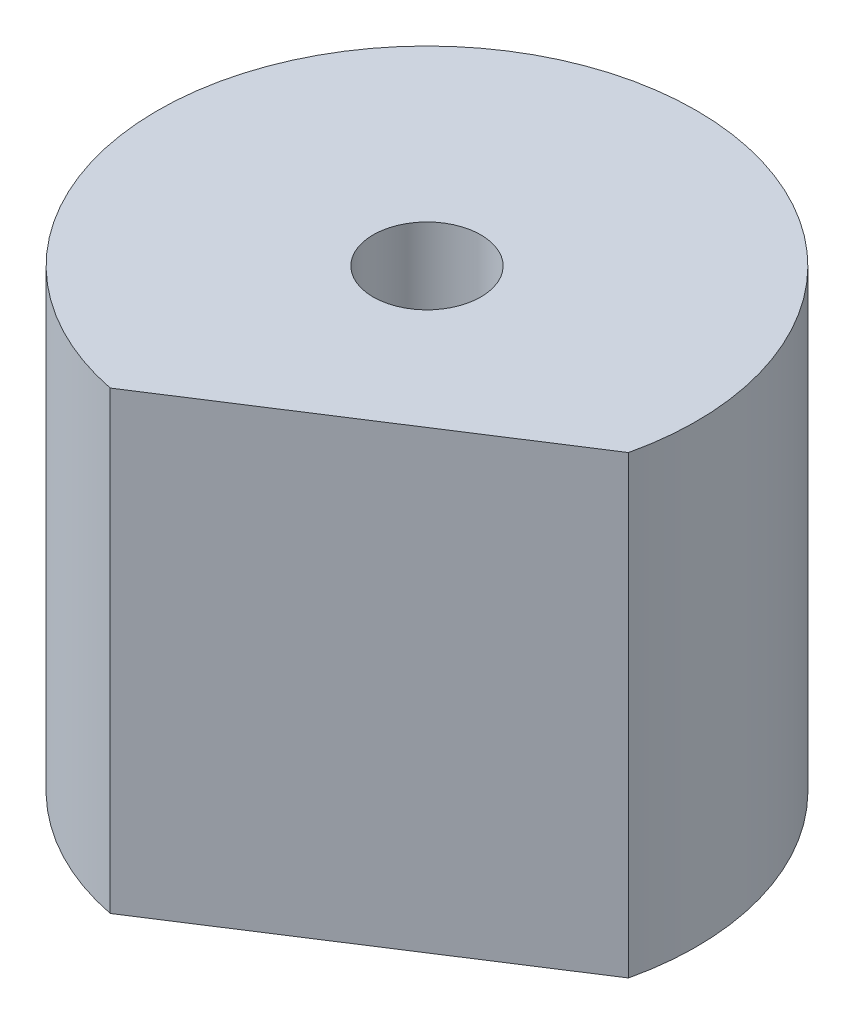
ISO-10303-21;
HEADER;
FILE_DESCRIPTION(('STEP AP214'),'2;1');
FILE_NAME('part.step','',(''),(''),'','','');
FILE_SCHEMA(('AUTOMOTIVE_DESIGN { 1 0 10303 214 1 1 1 1 }'));
ENDSEC;
DATA;
#1=APPLICATION_CONTEXT('core data for automotive mechanical design processes');
#2=APPLICATION_PROTOCOL_DEFINITION('international standard','automotive_design',2000,#1);
#3=PRODUCT_CONTEXT('',#1,'mechanical');
#4=PRODUCT('Part','Part','',(#3));
#5=PRODUCT_RELATED_PRODUCT_CATEGORY('part','',(#4));
#6=PRODUCT_DEFINITION_FORMATION('','',#4);
#7=PRODUCT_DEFINITION_CONTEXT('part definition',#1,'design');
#8=PRODUCT_DEFINITION('design','',#6,#7);
#9=PRODUCT_DEFINITION_SHAPE('','',#8);
#10=(LENGTH_UNIT() NAMED_UNIT(*) SI_UNIT(.MILLI.,.METRE.));
#11=(NAMED_UNIT(*) PLANE_ANGLE_UNIT() SI_UNIT($,.RADIAN.));
#12=(NAMED_UNIT(*) SI_UNIT($,.STERADIAN.) SOLID_ANGLE_UNIT());
#13=UNCERTAINTY_MEASURE_WITH_UNIT(LENGTH_MEASURE(1.E-05),#10,'distance_accuracy_value','');
#14=(GEOMETRIC_REPRESENTATION_CONTEXT(3) GLOBAL_UNCERTAINTY_ASSIGNED_CONTEXT((#13)) GLOBAL_UNIT_ASSIGNED_CONTEXT((#10,
#11,#12)) REPRESENTATION_CONTEXT('',''));
#15=CARTESIAN_POINT('',(0.,0.,0.));
#16=DIRECTION('',(0.,0.,1.));
#17=DIRECTION('',(1.,0.,0.));
#18=AXIS2_PLACEMENT_3D('',#15,#16,#17);
#19=CARTESIAN_POINT('',(0.,13.4112,0.));
#20=DIRECTION('',(0.,1.,0.));
#21=DIRECTION('',(0.,0.,1.));
#22=AXIS2_PLACEMENT_3D('',#19,#20,#21);
#23=PLANE('',#22);
#24=DIRECTION('',(-0.840244301090641,0.,0.542207999281364));
#25=VECTOR('',#24,1.);
#26=CARTESIAN_POINT('',(3.09054350014873,13.4112,4.78932728162343));
#27=LINE('',#26,#25);
#28=CARTESIAN_POINT('',(7.73206939476792,13.4112,1.79415972658324));
#29=VERTEX_POINT('',#28);
#30=CARTESIAN_POINT('',(-1.55098239447046,13.4112,7.78449483666363));
#31=VERTEX_POINT('',#30);
#32=EDGE_CURVE('E62',#29,#31,#27,.T.);
#33=ORIENTED_EDGE('',*,*,#32,.F.);
#34=CARTESIAN_POINT('',(0.,13.4112,0.));
#35=DIRECTION('',(0.,1.,0.));
#36=DIRECTION('',(0.,0.,1.));
#37=AXIS2_PLACEMENT_3D('',#34,#35,#36);
#38=CIRCLE('',#37,7.9375);
#39=EDGE_CURVE('E76',#29,#31,#38,.T.);
#40=ORIENTED_EDGE('',*,*,#39,.T.);
#41=EDGE_LOOP('',(#33,#40));
#42=FACE_BOUND('',#41,.T.);
#43=CARTESIAN_POINT('',(0.,13.4112,0.));
#44=DIRECTION('',(0.,1.,0.));
#45=DIRECTION('',(0.,0.,1.));
#46=AXIS2_PLACEMENT_3D('',#43,#44,#45);
#47=CIRCLE('',#46,1.5875);
#48=CARTESIAN_POINT('',(0.,13.4112,1.5875));
#49=VERTEX_POINT('',#48);
#50=EDGE_CURVE('E83',#49,#49,#47,.T.);
#51=ORIENTED_EDGE('',*,*,#50,.F.);
#52=EDGE_LOOP('',(#51));
#53=FACE_BOUND('',#52,.T.);
#54=ADVANCED_FACE('F47',(#42,#53),#23,.T.);
#55=CARTESIAN_POINT('',(0.,0.,0.));
#56=DIRECTION('',(0.,1.,0.));
#57=DIRECTION('',(0.,0.,1.));
#58=AXIS2_PLACEMENT_3D('',#55,#56,#57);
#59=PLANE('',#58);
#60=CARTESIAN_POINT('',(0.,0.,0.));
#61=DIRECTION('',(0.,1.,0.));
#62=DIRECTION('',(0.,0.,1.));
#63=AXIS2_PLACEMENT_3D('',#60,#61,#62);
#64=CIRCLE('',#63,7.9375);
#65=CARTESIAN_POINT('',(7.73206939476792,0.,1.79415972658324));
#66=VERTEX_POINT('',#65);
#67=CARTESIAN_POINT('',(-1.55098239447046,0.,7.78449483666363));
#68=VERTEX_POINT('',#67);
#69=EDGE_CURVE('E81',#66,#68,#64,.T.);
#70=ORIENTED_EDGE('',*,*,#69,.F.);
#71=DIRECTION('',(-0.840244301090641,0.,0.542207999281364));
#72=VECTOR('',#71,1.);
#73=CARTESIAN_POINT('',(3.09054350014873,0.,4.78932728162343));
#74=LINE('',#73,#72);
#75=EDGE_CURVE('E71',#66,#68,#74,.T.);
#76=ORIENTED_EDGE('',*,*,#75,.T.);
#77=EDGE_LOOP('',(#70,#76));
#78=FACE_BOUND('',#77,.T.);
#79=CARTESIAN_POINT('',(0.,0.,0.));
#80=DIRECTION('',(0.,1.,0.));
#81=DIRECTION('',(0.,0.,1.));
#82=AXIS2_PLACEMENT_3D('',#79,#80,#81);
#83=CIRCLE('',#82,1.5875);
#84=CARTESIAN_POINT('',(0.,0.,1.5875));
#85=VERTEX_POINT('',#84);
#86=EDGE_CURVE('E87',#85,#85,#83,.T.);
#87=ORIENTED_EDGE('',*,*,#86,.T.);
#88=EDGE_LOOP('',(#87));
#89=FACE_BOUND('',#88,.T.);
#90=ADVANCED_FACE('F79',(#78,#89),#59,.F.);
#91=CARTESIAN_POINT('',(0.,13.4112,0.));
#92=DIRECTION('',(0.,-1.,0.));
#93=DIRECTION('',(0.,0.,-1.));
#94=AXIS2_PLACEMENT_3D('',#91,#92,#93);
#95=CYLINDRICAL_SURFACE('',#94,7.9375);
#96=ORIENTED_EDGE('',*,*,#39,.F.);
#97=DIRECTION('',(0.,-1.,0.));
#98=VECTOR('',#97,1.);
#99=CARTESIAN_POINT('',(7.73206939476792,13.4112,1.79415972658324));
#100=LINE('',#99,#98);
#101=EDGE_CURVE('E13',#29,#66,#100,.T.);
#102=ORIENTED_EDGE('',*,*,#101,.T.);
#103=ORIENTED_EDGE('',*,*,#69,.T.);
#104=DIRECTION('',(0.,-1.,0.));
#105=VECTOR('',#104,1.);
#106=CARTESIAN_POINT('',(-1.55098239447046,13.4112,7.78449483666363));
#107=LINE('',#106,#105);
#108=EDGE_CURVE('E55',#68,#31,#107,.F.);
#109=ORIENTED_EDGE('',*,*,#108,.T.);
#110=EDGE_LOOP('',(#96,#102,#103,#109));
#111=FACE_BOUND('',#110,.T.);
#112=ADVANCED_FACE('F49',(#111),#95,.T.);
#113=CARTESIAN_POINT('',(0.,13.4112,0.));
#114=DIRECTION('',(0.,-1.,0.));
#115=DIRECTION('',(0.,0.,-1.));
#116=AXIS2_PLACEMENT_3D('',#113,#114,#115);
#117=CYLINDRICAL_SURFACE('',#116,1.5875);
#118=ORIENTED_EDGE('',*,*,#50,.T.);
#119=EDGE_LOOP('',(#118));
#120=FACE_BOUND('',#119,.T.);
#121=ORIENTED_EDGE('',*,*,#86,.F.);
#122=EDGE_LOOP('',(#121));
#123=FACE_BOUND('',#122,.T.);
#124=ADVANCED_FACE('F94',(#120,#123),#117,.F.);
#125=CARTESIAN_POINT('',(8.84885504016327,-49.4531499449741,1.073500140282));
#126=DIRECTION('',(-0.542207999281364,0.,-0.840244301090642));
#127=DIRECTION('',(-0.840244301090641,0.,0.542207999281364));
#128=AXIS2_PLACEMENT_3D('',#125,#126,#127);
#129=PLANE('',#128);
#130=ORIENTED_EDGE('',*,*,#101,.F.);
#131=ORIENTED_EDGE('',*,*,#32,.T.);
#132=ORIENTED_EDGE('',*,*,#108,.F.);
#133=ORIENTED_EDGE('',*,*,#75,.F.);
#134=EDGE_LOOP('',(#130,#131,#132,#133));
#135=FACE_BOUND('',#134,.T.);
#136=ADVANCED_FACE('F70',(#135),#129,.F.);
#137=CLOSED_SHELL('',(#54,#90,#112,#124,#136));
#138=MANIFOLD_SOLID_BREP('B2',#137);
#139=ADVANCED_BREP_SHAPE_REPRESENTATION('',(#18,#138),#14);
#140=SHAPE_DEFINITION_REPRESENTATION(#9,#139);
ENDSEC;
END-ISO-10303-21;
